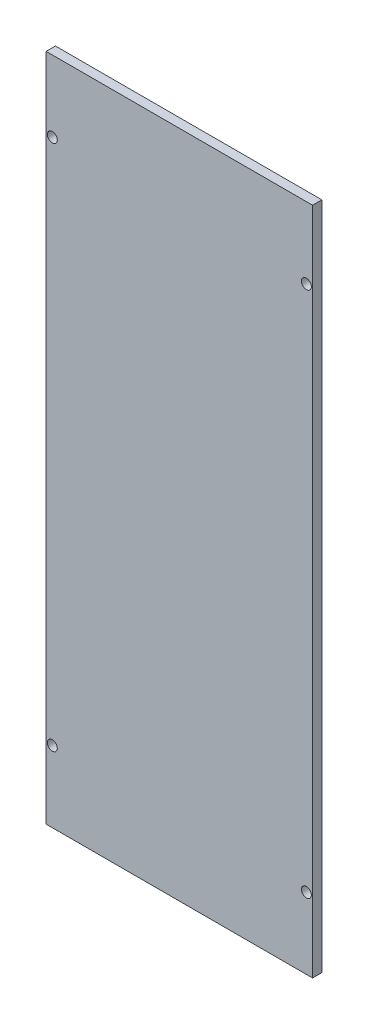
ISO-10303-21;
HEADER;
FILE_DESCRIPTION(('STEP AP214'),'2;1');
FILE_NAME('part.step','',(''),(''),'','','');
FILE_SCHEMA(('AUTOMOTIVE_DESIGN { 1 0 10303 214 1 1 1 1 }'));
ENDSEC;
DATA;
#1=APPLICATION_CONTEXT('core data for automotive mechanical design processes');
#2=APPLICATION_PROTOCOL_DEFINITION('international standard','automotive_design',2000,#1);
#3=PRODUCT_CONTEXT('',#1,'mechanical');
#4=PRODUCT('Part','Part','',(#3));
#5=PRODUCT_RELATED_PRODUCT_CATEGORY('part','',(#4));
#6=PRODUCT_DEFINITION_FORMATION('','',#4);
#7=PRODUCT_DEFINITION_CONTEXT('part definition',#1,'design');
#8=PRODUCT_DEFINITION('design','',#6,#7);
#9=PRODUCT_DEFINITION_SHAPE('','',#8);
#10=(LENGTH_UNIT() NAMED_UNIT(*) SI_UNIT(.MILLI.,.METRE.));
#11=(NAMED_UNIT(*) PLANE_ANGLE_UNIT() SI_UNIT($,.RADIAN.));
#12=(NAMED_UNIT(*) SI_UNIT($,.STERADIAN.) SOLID_ANGLE_UNIT());
#13=UNCERTAINTY_MEASURE_WITH_UNIT(LENGTH_MEASURE(1.E-05),#10,'distance_accuracy_value','');
#14=(GEOMETRIC_REPRESENTATION_CONTEXT(3) GLOBAL_UNCERTAINTY_ASSIGNED_CONTEXT((#13)) GLOBAL_UNIT_ASSIGNED_CONTEXT((#10,
#11,#12)) REPRESENTATION_CONTEXT('',''));
#15=CARTESIAN_POINT('',(0.,0.,0.));
#16=DIRECTION('',(0.,0.,1.));
#17=DIRECTION('',(1.,0.,0.));
#18=AXIS2_PLACEMENT_3D('',#15,#16,#17);
#19=CARTESIAN_POINT('',(0.,0.,3.));
#20=DIRECTION('',(1.,0.,0.));
#21=DIRECTION('',(0.,0.,-1.));
#22=AXIS2_PLACEMENT_3D('',#19,#20,#21);
#23=PLANE('',#22);
#24=DIRECTION('',(0.,-1.,0.));
#25=VECTOR('',#24,1.);
#26=CARTESIAN_POINT('',(0.,0.,0.));
#27=LINE('',#26,#25);
#28=CARTESIAN_POINT('',(0.,216.,0.));
#29=VERTEX_POINT('',#28);
#30=CARTESIAN_POINT('',(0.,0.,0.));
#31=VERTEX_POINT('',#30);
#32=EDGE_CURVE('E98',#29,#31,#27,.T.);
#33=ORIENTED_EDGE('',*,*,#32,.T.);
#34=DIRECTION('',(0.,0.,-1.));
#35=VECTOR('',#34,1.);
#36=CARTESIAN_POINT('',(0.,0.,3.));
#37=LINE('',#36,#35);
#38=CARTESIAN_POINT('',(0.,0.,3.));
#39=VERTEX_POINT('',#38);
#40=EDGE_CURVE('E11',#39,#31,#37,.T.);
#41=ORIENTED_EDGE('',*,*,#40,.F.);
#42=DIRECTION('',(0.,-1.,0.));
#43=VECTOR('',#42,1.);
#44=CARTESIAN_POINT('',(0.,0.,3.));
#45=LINE('',#44,#43);
#46=CARTESIAN_POINT('',(0.,216.,3.));
#47=VERTEX_POINT('',#46);
#48=EDGE_CURVE('E86',#47,#39,#45,.T.);
#49=ORIENTED_EDGE('',*,*,#48,.F.);
#50=DIRECTION('',(0.,0.,-1.));
#51=VECTOR('',#50,1.);
#52=CARTESIAN_POINT('',(0.,216.,3.));
#53=LINE('',#52,#51);
#54=EDGE_CURVE('E94',#47,#29,#53,.T.);
#55=ORIENTED_EDGE('',*,*,#54,.T.);
#56=EDGE_LOOP('',(#33,#41,#49,#55));
#57=FACE_BOUND('',#56,.T.);
#58=ADVANCED_FACE('F35',(#57),#23,.F.);
#59=CARTESIAN_POINT('',(0.,0.,3.));
#60=DIRECTION('',(0.,1.,0.));
#61=DIRECTION('',(0.,0.,1.));
#62=AXIS2_PLACEMENT_3D('',#59,#60,#61);
#63=PLANE('',#62);
#64=DIRECTION('',(1.,0.,0.));
#65=VECTOR('',#64,1.);
#66=CARTESIAN_POINT('',(0.,0.,0.));
#67=LINE('',#66,#65);
#68=CARTESIAN_POINT('',(86.0000000000001,0.,0.));
#69=VERTEX_POINT('',#68);
#70=EDGE_CURVE('E90',#31,#69,#67,.T.);
#71=ORIENTED_EDGE('',*,*,#70,.T.);
#72=DIRECTION('',(0.,0.,-1.));
#73=VECTOR('',#72,1.);
#74=CARTESIAN_POINT('',(86.0000000000001,0.,3.));
#75=LINE('',#74,#73);
#76=CARTESIAN_POINT('',(86.0000000000001,0.,3.));
#77=VERTEX_POINT('',#76);
#78=EDGE_CURVE('E43',#77,#69,#75,.T.);
#79=ORIENTED_EDGE('',*,*,#78,.F.);
#80=DIRECTION('',(1.,0.,0.));
#81=VECTOR('',#80,1.);
#82=CARTESIAN_POINT('',(0.,0.,3.));
#83=LINE('',#82,#81);
#84=EDGE_CURVE('E81',#39,#77,#83,.T.);
#85=ORIENTED_EDGE('',*,*,#84,.F.);
#86=ORIENTED_EDGE('',*,*,#40,.T.);
#87=EDGE_LOOP('',(#71,#79,#85,#86));
#88=FACE_BOUND('',#87,.T.);
#89=ADVANCED_FACE('F89',(#88),#63,.F.);
#90=CARTESIAN_POINT('',(86.0000000000001,0.,3.));
#91=DIRECTION('',(-1.,0.,0.));
#92=DIRECTION('',(0.,-1.,0.));
#93=AXIS2_PLACEMENT_3D('',#90,#91,#92);
#94=PLANE('',#93);
#95=DIRECTION('',(0.,1.,0.));
#96=VECTOR('',#95,1.);
#97=CARTESIAN_POINT('',(86.0000000000001,0.,0.));
#98=LINE('',#97,#96);
#99=CARTESIAN_POINT('',(86.,216.,0.));
#100=VERTEX_POINT('',#99);
#101=EDGE_CURVE('E68',#69,#100,#98,.T.);
#102=ORIENTED_EDGE('',*,*,#101,.T.);
#103=DIRECTION('',(0.,0.,-1.));
#104=VECTOR('',#103,1.);
#105=CARTESIAN_POINT('',(86.,216.,3.));
#106=LINE('',#105,#104);
#107=CARTESIAN_POINT('',(86.,216.,3.));
#108=VERTEX_POINT('',#107);
#109=EDGE_CURVE('E91',#108,#100,#106,.T.);
#110=ORIENTED_EDGE('',*,*,#109,.F.);
#111=DIRECTION('',(0.,1.,0.));
#112=VECTOR('',#111,1.);
#113=CARTESIAN_POINT('',(86.0000000000001,0.,3.));
#114=LINE('',#113,#112);
#115=EDGE_CURVE('E84',#77,#108,#114,.T.);
#116=ORIENTED_EDGE('',*,*,#115,.F.);
#117=ORIENTED_EDGE('',*,*,#78,.T.);
#118=EDGE_LOOP('',(#102,#110,#116,#117));
#119=FACE_BOUND('',#118,.T.);
#120=ADVANCED_FACE('F92',(#119),#94,.F.);
#121=CARTESIAN_POINT('',(0.,216.,3.));
#122=DIRECTION('',(0.,-1.,0.));
#123=DIRECTION('',(0.,0.,-1.));
#124=AXIS2_PLACEMENT_3D('',#121,#122,#123);
#125=PLANE('',#124);
#126=DIRECTION('',(-1.,0.,0.));
#127=VECTOR('',#126,1.);
#128=CARTESIAN_POINT('',(0.,216.,0.));
#129=LINE('',#128,#127);
#130=EDGE_CURVE('E74',#100,#29,#129,.T.);
#131=ORIENTED_EDGE('',*,*,#130,.T.);
#132=ORIENTED_EDGE('',*,*,#54,.F.);
#133=DIRECTION('',(-1.,0.,0.));
#134=VECTOR('',#133,1.);
#135=CARTESIAN_POINT('',(0.,216.,3.));
#136=LINE('',#135,#134);
#137=EDGE_CURVE('E51',#108,#47,#136,.T.);
#138=ORIENTED_EDGE('',*,*,#137,.F.);
#139=ORIENTED_EDGE('',*,*,#109,.T.);
#140=EDGE_LOOP('',(#131,#132,#138,#139));
#141=FACE_BOUND('',#140,.T.);
#142=ADVANCED_FACE('F106',(#141),#125,.F.);
#143=CARTESIAN_POINT('',(0.,0.,3.));
#144=DIRECTION('',(0.,0.,-1.));
#145=DIRECTION('',(-1.,0.,0.));
#146=AXIS2_PLACEMENT_3D('',#143,#144,#145);
#147=PLANE('',#146);
#148=CARTESIAN_POINT('',(2.,23.,3.));
#149=DIRECTION('',(0.,0.,1.));
#150=DIRECTION('',(-1.,0.,0.));
#151=AXIS2_PLACEMENT_3D('',#148,#149,#150);
#152=CIRCLE('',#151,1.59999999999999);
#153=CARTESIAN_POINT('',(0.400000000000008,23.,3.));
#154=VERTEX_POINT('',#153);
#155=EDGE_CURVE('E130',#154,#154,#152,.T.);
#156=ORIENTED_EDGE('',*,*,#155,.F.);
#157=EDGE_LOOP('',(#156));
#158=FACE_BOUND('',#157,.T.);
#159=CARTESIAN_POINT('',(84.,23.,3.));
#160=DIRECTION('',(0.,0.,1.));
#161=DIRECTION('',(1.,0.,0.));
#162=AXIS2_PLACEMENT_3D('',#159,#160,#161);
#163=CIRCLE('',#162,1.6);
#164=CARTESIAN_POINT('',(85.6,23.,3.));
#165=VERTEX_POINT('',#164);
#166=EDGE_CURVE('E124',#165,#165,#163,.T.);
#167=ORIENTED_EDGE('',*,*,#166,.F.);
#168=EDGE_LOOP('',(#167));
#169=FACE_BOUND('',#168,.T.);
#170=CARTESIAN_POINT('',(84.,193.,3.));
#171=DIRECTION('',(0.,0.,1.));
#172=DIRECTION('',(-1.,0.,0.));
#173=AXIS2_PLACEMENT_3D('',#170,#171,#172);
#174=CIRCLE('',#173,1.6);
#175=CARTESIAN_POINT('',(82.4,193.,3.));
#176=VERTEX_POINT('',#175);
#177=EDGE_CURVE('E118',#176,#176,#174,.T.);
#178=ORIENTED_EDGE('',*,*,#177,.F.);
#179=EDGE_LOOP('',(#178));
#180=FACE_BOUND('',#179,.T.);
#181=CARTESIAN_POINT('',(2.,193.,3.));
#182=DIRECTION('',(0.,0.,1.));
#183=DIRECTION('',(1.,0.,0.));
#184=AXIS2_PLACEMENT_3D('',#181,#182,#183);
#185=CIRCLE('',#184,1.59999999999999);
#186=CARTESIAN_POINT('',(3.59999999999999,193.,3.));
#187=VERTEX_POINT('',#186);
#188=EDGE_CURVE('E112',#187,#187,#185,.T.);
#189=ORIENTED_EDGE('',*,*,#188,.F.);
#190=EDGE_LOOP('',(#189));
#191=FACE_BOUND('',#190,.T.);
#192=ORIENTED_EDGE('',*,*,#48,.T.);
#193=ORIENTED_EDGE('',*,*,#84,.T.);
#194=ORIENTED_EDGE('',*,*,#115,.T.);
#195=ORIENTED_EDGE('',*,*,#137,.T.);
#196=EDGE_LOOP('',(#192,#193,#194,#195));
#197=FACE_BOUND('',#196,.T.);
#198=ADVANCED_FACE('F82',(#158,#169,#180,#191,#197),#147,.F.);
#199=CARTESIAN_POINT('',(0.,0.,0.));
#200=DIRECTION('',(0.,0.,-1.));
#201=DIRECTION('',(-1.,0.,0.));
#202=AXIS2_PLACEMENT_3D('',#199,#200,#201);
#203=PLANE('',#202);
#204=CARTESIAN_POINT('',(2.,23.,0.));
#205=DIRECTION('',(0.,0.,1.));
#206=DIRECTION('',(-1.,0.,0.));
#207=AXIS2_PLACEMENT_3D('',#204,#205,#206);
#208=CIRCLE('',#207,1.59999999999999);
#209=CARTESIAN_POINT('',(0.400000000000008,23.,0.));
#210=VERTEX_POINT('',#209);
#211=EDGE_CURVE('E115',#210,#210,#208,.T.);
#212=ORIENTED_EDGE('',*,*,#211,.T.);
#213=EDGE_LOOP('',(#212));
#214=FACE_BOUND('',#213,.T.);
#215=CARTESIAN_POINT('',(84.,23.,0.));
#216=DIRECTION('',(0.,0.,1.));
#217=DIRECTION('',(1.,0.,0.));
#218=AXIS2_PLACEMENT_3D('',#215,#216,#217);
#219=CIRCLE('',#218,1.6);
#220=CARTESIAN_POINT('',(85.6,23.,0.));
#221=VERTEX_POINT('',#220);
#222=EDGE_CURVE('E127',#221,#221,#219,.T.);
#223=ORIENTED_EDGE('',*,*,#222,.T.);
#224=EDGE_LOOP('',(#223));
#225=FACE_BOUND('',#224,.T.);
#226=CARTESIAN_POINT('',(84.,193.,0.));
#227=DIRECTION('',(0.,0.,1.));
#228=DIRECTION('',(-1.,0.,0.));
#229=AXIS2_PLACEMENT_3D('',#226,#227,#228);
#230=CIRCLE('',#229,1.6);
#231=CARTESIAN_POINT('',(82.4,193.,0.));
#232=VERTEX_POINT('',#231);
#233=EDGE_CURVE('E121',#232,#232,#230,.T.);
#234=ORIENTED_EDGE('',*,*,#233,.T.);
#235=EDGE_LOOP('',(#234));
#236=FACE_BOUND('',#235,.T.);
#237=CARTESIAN_POINT('',(2.,193.,0.));
#238=DIRECTION('',(0.,0.,1.));
#239=DIRECTION('',(1.,0.,0.));
#240=AXIS2_PLACEMENT_3D('',#237,#238,#239);
#241=CIRCLE('',#240,1.59999999999999);
#242=CARTESIAN_POINT('',(3.59999999999999,193.,0.));
#243=VERTEX_POINT('',#242);
#244=EDGE_CURVE('E101',#243,#243,#241,.T.);
#245=ORIENTED_EDGE('',*,*,#244,.T.);
#246=EDGE_LOOP('',(#245));
#247=FACE_BOUND('',#246,.T.);
#248=ORIENTED_EDGE('',*,*,#32,.F.);
#249=ORIENTED_EDGE('',*,*,#130,.F.);
#250=ORIENTED_EDGE('',*,*,#101,.F.);
#251=ORIENTED_EDGE('',*,*,#70,.F.);
#252=EDGE_LOOP('',(#248,#249,#250,#251));
#253=FACE_BOUND('',#252,.T.);
#254=ADVANCED_FACE('F109',(#214,#225,#236,#247,#253),#203,.T.);
#255=CARTESIAN_POINT('',(2.,193.,0.));
#256=DIRECTION('',(0.,0.,1.));
#257=DIRECTION('',(1.,0.,0.));
#258=AXIS2_PLACEMENT_3D('',#255,#256,#257);
#259=CYLINDRICAL_SURFACE('',#258,1.59999999999999);
#260=ORIENTED_EDGE('',*,*,#244,.F.);
#261=EDGE_LOOP('',(#260));
#262=FACE_BOUND('',#261,.T.);
#263=ORIENTED_EDGE('',*,*,#188,.T.);
#264=EDGE_LOOP('',(#263));
#265=FACE_BOUND('',#264,.T.);
#266=ADVANCED_FACE('F154',(#262,#265),#259,.F.);
#267=CARTESIAN_POINT('',(84.,193.,0.));
#268=DIRECTION('',(0.,0.,1.));
#269=DIRECTION('',(1.,0.,0.));
#270=AXIS2_PLACEMENT_3D('',#267,#268,#269);
#271=CYLINDRICAL_SURFACE('',#270,1.6);
#272=ORIENTED_EDGE('',*,*,#233,.F.);
#273=EDGE_LOOP('',(#272));
#274=FACE_BOUND('',#273,.T.);
#275=ORIENTED_EDGE('',*,*,#177,.T.);
#276=EDGE_LOOP('',(#275));
#277=FACE_BOUND('',#276,.T.);
#278=ADVANCED_FACE('F156',(#274,#277),#271,.F.);
#279=CARTESIAN_POINT('',(84.,23.,0.));
#280=DIRECTION('',(0.,0.,1.));
#281=DIRECTION('',(1.,0.,0.));
#282=AXIS2_PLACEMENT_3D('',#279,#280,#281);
#283=CYLINDRICAL_SURFACE('',#282,1.6);
#284=ORIENTED_EDGE('',*,*,#222,.F.);
#285=EDGE_LOOP('',(#284));
#286=FACE_BOUND('',#285,.T.);
#287=ORIENTED_EDGE('',*,*,#166,.T.);
#288=EDGE_LOOP('',(#287));
#289=FACE_BOUND('',#288,.T.);
#290=ADVANCED_FACE('F141',(#286,#289),#283,.F.);
#291=CARTESIAN_POINT('',(2.,23.,0.));
#292=DIRECTION('',(0.,0.,1.));
#293=DIRECTION('',(1.,0.,0.));
#294=AXIS2_PLACEMENT_3D('',#291,#292,#293);
#295=CYLINDRICAL_SURFACE('',#294,1.59999999999999);
#296=ORIENTED_EDGE('',*,*,#211,.F.);
#297=EDGE_LOOP('',(#296));
#298=FACE_BOUND('',#297,.T.);
#299=ORIENTED_EDGE('',*,*,#155,.T.);
#300=EDGE_LOOP('',(#299));
#301=FACE_BOUND('',#300,.T.);
#302=ADVANCED_FACE('F138',(#298,#301),#295,.F.);
#303=CLOSED_SHELL('',(#58,#89,#120,#142,#198,#254,#266,#278,#290,#302));
#304=MANIFOLD_SOLID_BREP('B2',#303);
#305=ADVANCED_BREP_SHAPE_REPRESENTATION('',(#18,#304),#14);
#306=SHAPE_DEFINITION_REPRESENTATION(#9,#305);
ENDSEC;
END-ISO-10303-21;
